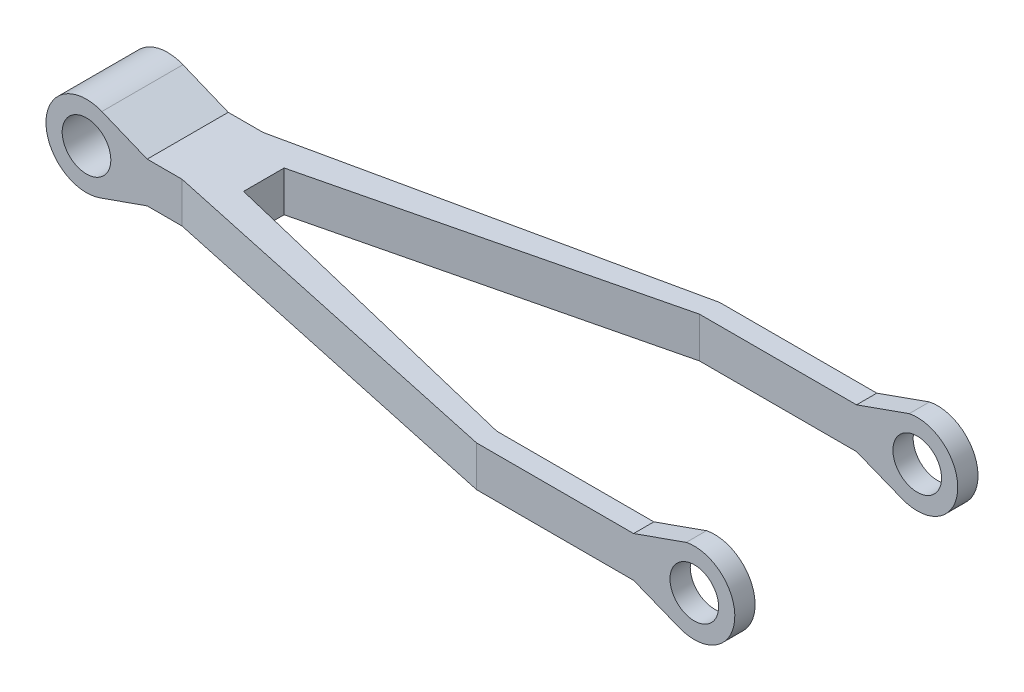
ISO-10303-21;
HEADER;
FILE_DESCRIPTION(('STEP AP214'),'2;1');
FILE_NAME('part.step','',(''),(''),'','','');
FILE_SCHEMA(('AUTOMOTIVE_DESIGN { 1 0 10303 214 1 1 1 1 }'));
ENDSEC;
DATA;
#1=APPLICATION_CONTEXT('core data for automotive mechanical design processes');
#2=APPLICATION_PROTOCOL_DEFINITION('international standard','automotive_design',2000,#1);
#3=PRODUCT_CONTEXT('',#1,'mechanical');
#4=PRODUCT('Part','Part','',(#3));
#5=PRODUCT_RELATED_PRODUCT_CATEGORY('part','',(#4));
#6=PRODUCT_DEFINITION_FORMATION('','',#4);
#7=PRODUCT_DEFINITION_CONTEXT('part definition',#1,'design');
#8=PRODUCT_DEFINITION('design','',#6,#7);
#9=PRODUCT_DEFINITION_SHAPE('','',#8);
#10=(LENGTH_UNIT() NAMED_UNIT(*) SI_UNIT(.MILLI.,.METRE.));
#11=(NAMED_UNIT(*) PLANE_ANGLE_UNIT() SI_UNIT($,.RADIAN.));
#12=(NAMED_UNIT(*) SI_UNIT($,.STERADIAN.) SOLID_ANGLE_UNIT());
#13=UNCERTAINTY_MEASURE_WITH_UNIT(LENGTH_MEASURE(1.E-05),#10,'distance_accuracy_value','');
#14=(GEOMETRIC_REPRESENTATION_CONTEXT(3) GLOBAL_UNCERTAINTY_ASSIGNED_CONTEXT((#13)) GLOBAL_UNIT_ASSIGNED_CONTEXT((#10,
#11,#12)) REPRESENTATION_CONTEXT('',''));
#15=CARTESIAN_POINT('',(0.,0.,0.));
#16=DIRECTION('',(0.,0.,1.));
#17=DIRECTION('',(1.,0.,0.));
#18=AXIS2_PLACEMENT_3D('',#15,#16,#17);
#19=CARTESIAN_POINT('',(425.,-1.27027906957698,300.));
#20=DIRECTION('',(0.,0.,-1.));
#21=DIRECTION('',(-1.,0.,0.));
#22=AXIS2_PLACEMENT_3D('',#19,#20,#21);
#23=CYLINDRICAL_SURFACE('',#22,50.);
#24=CARTESIAN_POINT('',(425.,-1.27027906957698,275.));
#25=DIRECTION('',(0.,0.,-1.));
#26=DIRECTION('',(-1.,0.,0.));
#27=AXIS2_PLACEMENT_3D('',#24,#25,#26);
#28=CIRCLE('',#27,50.);
#29=CARTESIAN_POINT('',(415.157857426218,47.7514735465561,275.));
#30=VERTEX_POINT('',#29);
#31=CARTESIAN_POINT('',(406.561253940114,-47.7462152488414,275.));
#32=VERTEX_POINT('',#31);
#33=EDGE_CURVE('E309',#30,#32,#28,.T.);
#34=ORIENTED_EDGE('',*,*,#33,.F.);
#35=DIRECTION('',(0.,0.,-1.));
#36=VECTOR('',#35,1.);
#37=CARTESIAN_POINT('',(415.157857426218,47.7514735465561,300.));
#38=LINE('',#37,#36);
#39=CARTESIAN_POINT('',(415.157857426218,47.7514735465561,300.));
#40=VERTEX_POINT('',#39);
#41=EDGE_CURVE('E214',#40,#30,#38,.T.);
#42=ORIENTED_EDGE('',*,*,#41,.F.);
#43=CARTESIAN_POINT('',(425.,-1.27027906957698,300.));
#44=DIRECTION('',(0.,0.,1.));
#45=DIRECTION('',(1.,0.,0.));
#46=AXIS2_PLACEMENT_3D('',#43,#44,#45);
#47=CIRCLE('',#46,50.);
#48=CARTESIAN_POINT('',(406.561253940114,-47.7462152488414,300.));
#49=VERTEX_POINT('',#48);
#50=EDGE_CURVE('E319',#49,#40,#47,.T.);
#51=ORIENTED_EDGE('',*,*,#50,.F.);
#52=DIRECTION('',(0.,0.,-1.));
#53=VECTOR('',#52,1.);
#54=CARTESIAN_POINT('',(406.561253940114,-47.7462152488414,300.));
#55=LINE('',#54,#53);
#56=EDGE_CURVE('E218',#49,#32,#55,.T.);
#57=ORIENTED_EDGE('',*,*,#56,.T.);
#58=EDGE_LOOP('',(#34,#42,#51,#57));
#59=FACE_BOUND('',#58,.T.);
#60=ADVANCED_FACE('F35',(#59),#23,.T.);
#61=CARTESIAN_POINT('',(415.157857426218,47.7514735465561,25.));
#62=VERTEX_POINT('',#61);
#63=CARTESIAN_POINT('',(415.157857426218,47.7514735465561,0.));
#64=VERTEX_POINT('',#63);
#65=EDGE_CURVE('E213',#62,#64,#38,.T.);
#66=ORIENTED_EDGE('',*,*,#65,.F.);
#67=CARTESIAN_POINT('',(425.,-1.27027906957698,25.));
#68=DIRECTION('',(0.,0.,1.));
#69=DIRECTION('',(1.,0.,0.));
#70=AXIS2_PLACEMENT_3D('',#67,#68,#69);
#71=CIRCLE('',#70,50.);
#72=CARTESIAN_POINT('',(406.561253940114,-47.7462152488414,25.));
#73=VERTEX_POINT('',#72);
#74=EDGE_CURVE('E313',#73,#62,#71,.T.);
#75=ORIENTED_EDGE('',*,*,#74,.F.);
#76=CARTESIAN_POINT('',(406.561253940114,-47.7462152488414,0.));
#77=VERTEX_POINT('',#76);
#78=EDGE_CURVE('E217',#73,#77,#55,.T.);
#79=ORIENTED_EDGE('',*,*,#78,.T.);
#80=CARTESIAN_POINT('',(425.,-1.27027906957698,0.));
#81=DIRECTION('',(0.,0.,1.));
#82=DIRECTION('',(1.,0.,0.));
#83=AXIS2_PLACEMENT_3D('',#80,#81,#82);
#84=CIRCLE('',#83,50.);
#85=EDGE_CURVE('E334',#77,#64,#84,.T.);
#86=ORIENTED_EDGE('',*,*,#85,.T.);
#87=EDGE_LOOP('',(#66,#75,#79,#86));
#88=FACE_BOUND('',#87,.T.);
#89=ADVANCED_FACE('F414',(#88),#23,.T.);
#90=CARTESIAN_POINT('',(31.4773013212196,-88.584386301868,300.));
#91=DIRECTION('',(-0.334826751212427,0.942279707238,0.));
#92=DIRECTION('',(-0.942279707238,-0.334826751212427,0.));
#93=AXIS2_PLACEMENT_3D('',#90,#91,#92);
#94=PLANE('',#93);
#95=ORIENTED_EDGE('',*,*,#41,.T.);
#96=DIRECTION('',(-0.942279707238,-0.334826751212427,0.));
#97=VECTOR('',#96,1.);
#98=CARTESIAN_POINT('',(31.4773013212196,-88.584386301868,275.));
#99=LINE('',#98,#97);
#100=CARTESIAN_POINT('',(350.126678984303,24.6434961190826,275.));
#101=VERTEX_POINT('',#100);
#102=EDGE_CURVE('E186',#30,#101,#99,.T.);
#103=ORIENTED_EDGE('',*,*,#102,.T.);
#104=DIRECTION('',(0.,0.,-1.));
#105=VECTOR('',#104,1.);
#106=CARTESIAN_POINT('',(350.126678984303,24.6434961190826,300.));
#107=LINE('',#106,#105);
#108=CARTESIAN_POINT('',(350.126678984303,24.6434961190826,300.));
#109=VERTEX_POINT('',#108);
#110=EDGE_CURVE('E206',#109,#101,#107,.T.);
#111=ORIENTED_EDGE('',*,*,#110,.F.);
#112=DIRECTION('',(0.942279707238,0.334826751212427,0.));
#113=VECTOR('',#112,1.);
#114=CARTESIAN_POINT('',(31.4773013212196,-88.584386301868,300.));
#115=LINE('',#114,#113);
#116=EDGE_CURVE('E322',#109,#40,#115,.T.);
#117=ORIENTED_EDGE('',*,*,#116,.T.);
#118=EDGE_LOOP('',(#95,#103,#111,#117));
#119=FACE_BOUND('',#118,.T.);
#120=ADVANCED_FACE('F374',(#119),#94,.T.);
#121=CARTESIAN_POINT('',(350.126678984303,24.6434961190826,25.));
#122=VERTEX_POINT('',#121);
#123=CARTESIAN_POINT('',(350.126678984303,24.6434961190826,0.));
#124=VERTEX_POINT('',#123);
#125=EDGE_CURVE('E204',#122,#124,#107,.T.);
#126=ORIENTED_EDGE('',*,*,#125,.F.);
#127=DIRECTION('',(0.942279707238,0.334826751212427,0.));
#128=VECTOR('',#127,1.);
#129=CARTESIAN_POINT('',(31.4773013212196,-88.584386301868,25.));
#130=LINE('',#129,#128);
#131=EDGE_CURVE('E260',#122,#62,#130,.T.);
#132=ORIENTED_EDGE('',*,*,#131,.T.);
#133=ORIENTED_EDGE('',*,*,#65,.T.);
#134=DIRECTION('',(0.942279707238,0.334826751212427,0.));
#135=VECTOR('',#134,1.);
#136=CARTESIAN_POINT('',(31.4773013212196,-88.584386301868,0.));
#137=LINE('',#136,#135);
#138=EDGE_CURVE('E337',#124,#64,#137,.T.);
#139=ORIENTED_EDGE('',*,*,#138,.F.);
#140=EDGE_LOOP('',(#126,#132,#133,#139));
#141=FACE_BOUND('',#140,.T.);
#142=ADVANCED_FACE('F394',(#141),#94,.T.);
#143=CARTESIAN_POINT('',(-41.6049629686722,-101.596288687072,300.));
#144=DIRECTION('',(-0.378967133157748,-0.925410131771961,0.));
#145=DIRECTION('',(0.925410131771961,-0.378967133157748,0.));
#146=AXIS2_PLACEMENT_3D('',#143,#144,#145);
#147=PLANE('',#146);
#148=DIRECTION('',(0.925410131771961,-0.378967133157748,0.));
#149=VECTOR('',#148,1.);
#150=CARTESIAN_POINT('',(-41.6049629686722,-101.596288687072,100.));
#151=LINE('',#150,#149);
#152=CARTESIAN_POINT('',(-405.780100699834,47.5380282768525,100.));
#153=VERTEX_POINT('',#152);
#154=CARTESIAN_POINT('',(-349.873321015697,24.6434961190825,100.));
#155=VERTEX_POINT('',#154);
#156=EDGE_CURVE('E185',#153,#155,#151,.T.);
#157=ORIENTED_EDGE('',*,*,#156,.F.);
#158=DIRECTION('',(0.,0.,-1.));
#159=VECTOR('',#158,1.);
#160=CARTESIAN_POINT('',(-405.780100699834,47.5380282768525,300.));
#161=LINE('',#160,#159);
#162=CARTESIAN_POINT('',(-405.780100699834,47.5380282768525,200.));
#163=VERTEX_POINT('',#162);
#164=EDGE_CURVE('E183',#163,#153,#161,.T.);
#165=ORIENTED_EDGE('',*,*,#164,.F.);
#166=DIRECTION('',(-0.925410131771961,0.378967133157748,0.));
#167=VECTOR('',#166,1.);
#168=CARTESIAN_POINT('',(-41.6049629686722,-101.596288687072,200.));
#169=LINE('',#168,#167);
#170=CARTESIAN_POINT('',(-349.873321015697,24.6434961190825,200.));
#171=VERTEX_POINT('',#170);
#172=EDGE_CURVE('E176',#171,#163,#169,.T.);
#173=ORIENTED_EDGE('',*,*,#172,.F.);
#174=DIRECTION('',(0.,0.,-1.));
#175=VECTOR('',#174,1.);
#176=CARTESIAN_POINT('',(-349.873321015697,24.6434961190825,300.));
#177=LINE('',#176,#175);
#178=EDGE_CURVE('E181',#171,#155,#177,.T.);
#179=ORIENTED_EDGE('',*,*,#178,.T.);
#180=EDGE_LOOP('',(#157,#165,#173,#179));
#181=FACE_BOUND('',#180,.T.);
#182=ADVANCED_FACE('F179',(#181),#147,.F.);
#183=CARTESIAN_POINT('',(-424.728457357722,1.26752168825442,300.));
#184=DIRECTION('',(0.,0.,-1.));
#185=DIRECTION('',(-1.,0.,0.));
#186=AXIS2_PLACEMENT_3D('',#183,#184,#185);
#187=CYLINDRICAL_SURFACE('',#186,50.);
#188=ORIENTED_EDGE('',*,*,#164,.T.);
#189=CARTESIAN_POINT('',(-424.728457357722,1.26752168825442,100.));
#190=DIRECTION('',(0.,0.,-1.));
#191=DIRECTION('',(-1.,0.,0.));
#192=AXIS2_PLACEMENT_3D('',#189,#190,#191);
#193=CIRCLE('',#192,50.);
#194=CARTESIAN_POINT('',(-408.102340797031,-45.8872474036448,100.));
#195=VERTEX_POINT('',#194);
#196=EDGE_CURVE('E301',#195,#153,#193,.T.);
#197=ORIENTED_EDGE('',*,*,#196,.F.);
#198=DIRECTION('',(0.,0.,-1.));
#199=VECTOR('',#198,1.);
#200=CARTESIAN_POINT('',(-408.102340797031,-45.8872474036448,300.));
#201=LINE('',#200,#199);
#202=CARTESIAN_POINT('',(-408.102340797031,-45.8872474036448,200.));
#203=VERTEX_POINT('',#202);
#204=EDGE_CURVE('E208',#203,#195,#201,.T.);
#205=ORIENTED_EDGE('',*,*,#204,.F.);
#206=CARTESIAN_POINT('',(-424.728457357722,1.26752168825442,200.));
#207=DIRECTION('',(0.,0.,1.));
#208=DIRECTION('',(1.,0.,0.));
#209=AXIS2_PLACEMENT_3D('',#206,#207,#208);
#210=CIRCLE('',#209,50.);
#211=EDGE_CURVE('E306',#163,#203,#210,.T.);
#212=ORIENTED_EDGE('',*,*,#211,.F.);
#213=EDGE_LOOP('',(#188,#197,#205,#212));
#214=FACE_BOUND('',#213,.T.);
#215=ADVANCED_FACE('F357',(#214),#187,.T.);
#216=CARTESIAN_POINT('',(38.9236741876808,98.1093937480238,300.));
#217=DIRECTION('',(0.368774921197711,0.929518723585287,0.));
#218=DIRECTION('',(-0.929518723585287,0.368774921197711,0.));
#219=AXIS2_PLACEMENT_3D('',#216,#217,#218);
#220=PLANE('',#219);
#221=DIRECTION('',(0.929518723585287,-0.368774921197711,0.));
#222=VECTOR('',#221,1.);
#223=CARTESIAN_POINT('',(38.9236741876808,98.1093937480238,25.));
#224=LINE('',#223,#222);
#225=CARTESIAN_POINT('',(350.126678984303,-25.3565038809175,25.));
#226=VERTEX_POINT('',#225);
#227=EDGE_CURVE('E311',#226,#73,#224,.T.);
#228=ORIENTED_EDGE('',*,*,#227,.F.);
#229=DIRECTION('',(0.,0.,-1.));
#230=VECTOR('',#229,1.);
#231=CARTESIAN_POINT('',(350.126678984303,-25.3565038809175,300.));
#232=LINE('',#231,#230);
#233=CARTESIAN_POINT('',(350.126678984303,-25.3565038809175,0.));
#234=VERTEX_POINT('',#233);
#235=EDGE_CURVE('E331',#226,#234,#232,.T.);
#236=ORIENTED_EDGE('',*,*,#235,.T.);
#237=DIRECTION('',(0.929518723585288,-0.368774921197711,0.));
#238=VECTOR('',#237,1.);
#239=CARTESIAN_POINT('',(38.9236741876808,98.1093937480238,0.));
#240=LINE('',#239,#238);
#241=EDGE_CURVE('E315',#234,#77,#240,.T.);
#242=ORIENTED_EDGE('',*,*,#241,.T.);
#243=ORIENTED_EDGE('',*,*,#78,.F.);
#244=EDGE_LOOP('',(#228,#236,#242,#243));
#245=FACE_BOUND('',#244,.T.);
#246=ADVANCED_FACE('F37',(#245),#220,.F.);
#247=DIRECTION('',(-0.929518723585287,0.368774921197711,0.));
#248=VECTOR('',#247,1.);
#249=CARTESIAN_POINT('',(38.9236741876808,98.1093937480238,275.));
#250=LINE('',#249,#248);
#251=CARTESIAN_POINT('',(350.126678984303,-25.3565038809175,275.));
#252=VERTEX_POINT('',#251);
#253=EDGE_CURVE('E60',#32,#252,#250,.T.);
#254=ORIENTED_EDGE('',*,*,#253,.F.);
#255=ORIENTED_EDGE('',*,*,#56,.F.);
#256=DIRECTION('',(0.929518723585288,-0.368774921197711,0.));
#257=VECTOR('',#256,1.);
#258=CARTESIAN_POINT('',(38.9236741876808,98.1093937480238,300.));
#259=LINE('',#258,#257);
#260=CARTESIAN_POINT('',(350.126678984303,-25.3565038809175,300.));
#261=VERTEX_POINT('',#260);
#262=EDGE_CURVE('E316',#261,#49,#259,.T.);
#263=ORIENTED_EDGE('',*,*,#262,.F.);
#264=EDGE_CURVE('E345',#261,#252,#232,.T.);
#265=ORIENTED_EDGE('',*,*,#264,.T.);
#266=EDGE_LOOP('',(#254,#255,#263,#265));
#267=FACE_BOUND('',#266,.T.);
#268=ADVANCED_FACE('F425',(#267),#220,.F.);
#269=CARTESIAN_POINT('',(0.,24.6434961190825,300.));
#270=DIRECTION('',(0.,-1.,0.));
#271=DIRECTION('',(1.,0.,0.));
#272=AXIS2_PLACEMENT_3D('',#269,#270,#271);
#273=PLANE('',#272);
#274=DIRECTION('',(1.,0.,0.));
#275=VECTOR('',#274,1.);
#276=CARTESIAN_POINT('',(156.384680344774,24.6434961190825,25.));
#277=LINE('',#276,#275);
#278=CARTESIAN_POINT('',(156.384680344774,24.6434961190825,25.));
#279=VERTEX_POINT('',#278);
#280=EDGE_CURVE('E279',#279,#122,#277,.T.);
#281=ORIENTED_EDGE('',*,*,#280,.T.);
#282=ORIENTED_EDGE('',*,*,#125,.T.);
#283=DIRECTION('',(-1.,0.,0.));
#284=VECTOR('',#283,1.);
#285=CARTESIAN_POINT('',(0.,24.6434961190825,0.));
#286=LINE('',#285,#284);
#287=CARTESIAN_POINT('',(156.384680344774,24.6434961190825,0.));
#288=VERTEX_POINT('',#287);
#289=EDGE_CURVE('E340',#124,#288,#286,.T.);
#290=ORIENTED_EDGE('',*,*,#289,.T.);
#291=DIRECTION('',(-0.977480249723305,0.,0.21102692103347));
#292=VECTOR('',#291,1.);
#293=CARTESIAN_POINT('',(156.384680344774,24.6434961190825,0.));
#294=LINE('',#293,#292);
#295=CARTESIAN_POINT('',(-306.81700261409,24.6434961190825,100.));
#296=VERTEX_POINT('',#295);
#297=EDGE_CURVE('E265',#288,#296,#294,.T.);
#298=ORIENTED_EDGE('',*,*,#297,.T.);
#299=DIRECTION('',(-1.,0.,0.));
#300=VECTOR('',#299,1.);
#301=CARTESIAN_POINT('',(-306.81700261409,24.6434961190825,100.));
#302=LINE('',#301,#300);
#303=EDGE_CURVE('E197',#296,#155,#302,.T.);
#304=ORIENTED_EDGE('',*,*,#303,.T.);
#305=ORIENTED_EDGE('',*,*,#178,.F.);
#306=DIRECTION('',(1.,0.,0.));
#307=VECTOR('',#306,1.);
#308=CARTESIAN_POINT('',(-623.605485164736,24.6434961190824,200.));
#309=LINE('',#308,#307);
#310=CARTESIAN_POINT('',(-306.81700261409,24.6434961190825,200.));
#311=VERTEX_POINT('',#310);
#312=EDGE_CURVE('E189',#171,#311,#309,.T.);
#313=ORIENTED_EDGE('',*,*,#312,.T.);
#314=DIRECTION('',(0.977480249723305,0.,0.211026921033469));
#315=VECTOR('',#314,1.);
#316=CARTESIAN_POINT('',(156.384680344774,24.6434961190825,300.));
#317=LINE('',#316,#315);
#318=CARTESIAN_POINT('',(156.384680344774,24.6434961190825,300.));
#319=VERTEX_POINT('',#318);
#320=EDGE_CURVE('E196',#311,#319,#317,.T.);
#321=ORIENTED_EDGE('',*,*,#320,.T.);
#322=DIRECTION('',(-1.,0.,0.));
#323=VECTOR('',#322,1.);
#324=CARTESIAN_POINT('',(0.,24.6434961190825,300.));
#325=LINE('',#324,#323);
#326=EDGE_CURVE('E325',#109,#319,#325,.T.);
#327=ORIENTED_EDGE('',*,*,#326,.F.);
#328=ORIENTED_EDGE('',*,*,#110,.T.);
#329=DIRECTION('',(-1.,0.,0.));
#330=VECTOR('',#329,1.);
#331=CARTESIAN_POINT('',(156.384680344774,24.6434961190825,275.));
#332=LINE('',#331,#330);
#333=CARTESIAN_POINT('',(156.384680344774,24.6434961190825,275.));
#334=VERTEX_POINT('',#333);
#335=EDGE_CURVE('E269',#101,#334,#332,.T.);
#336=ORIENTED_EDGE('',*,*,#335,.T.);
#337=DIRECTION('',(-0.971828656597541,0.,-0.235688485539321));
#338=VECTOR('',#337,1.);
#339=CARTESIAN_POINT('',(156.384680344774,24.6434961190825,275.));
#340=LINE('',#339,#338);
#341=CARTESIAN_POINT('',(-255.95139724244,24.6434961190825,175.));
#342=VERTEX_POINT('',#341);
#343=EDGE_CURVE('E52',#334,#342,#340,.T.);
#344=ORIENTED_EDGE('',*,*,#343,.T.);
#345=DIRECTION('',(0.,0.,-1.));
#346=VECTOR('',#345,1.);
#347=CARTESIAN_POINT('',(-255.95139724244,24.6434961190825,150.));
#348=LINE('',#347,#346);
#349=CARTESIAN_POINT('',(-255.95139724244,24.6434961190825,125.));
#350=VERTEX_POINT('',#349);
#351=EDGE_CURVE('E273',#342,#350,#348,.T.);
#352=ORIENTED_EDGE('',*,*,#351,.T.);
#353=DIRECTION('',(0.971828656597541,0.,-0.235688485539321));
#354=VECTOR('',#353,1.);
#355=CARTESIAN_POINT('',(-255.95139724244,24.6434961190825,125.));
#356=LINE('',#355,#354);
#357=EDGE_CURVE('E276',#350,#279,#356,.T.);
#358=ORIENTED_EDGE('',*,*,#357,.T.);
#359=EDGE_LOOP('',(#281,#282,#290,#298,#304,#305,#313,#321,#327,#328,#336,#344,#352,#358));
#360=FACE_BOUND('',#359,.T.);
#361=ADVANCED_FACE('F201',(#360),#273,.F.);
#362=CARTESIAN_POINT('',(-30.7340716416046,87.1675623242215,300.));
#363=DIRECTION('',(0.332522331213809,-0.943095381837985,0.));
#364=DIRECTION('',(0.943095381837985,0.332522331213809,0.));
#365=AXIS2_PLACEMENT_3D('',#362,#363,#364);
#366=PLANE('',#365);
#367=DIRECTION('',(0.,0.,-1.));
#368=VECTOR('',#367,1.);
#369=CARTESIAN_POINT('',(-349.873321015697,-25.3565038809175,300.));
#370=LINE('',#369,#368);
#371=CARTESIAN_POINT('',(-349.873321015697,-25.3565038809175,200.));
#372=VERTEX_POINT('',#371);
#373=CARTESIAN_POINT('',(-349.873321015697,-25.3565038809175,100.));
#374=VERTEX_POINT('',#373);
#375=EDGE_CURVE('E348',#372,#374,#370,.T.);
#376=ORIENTED_EDGE('',*,*,#375,.F.);
#377=DIRECTION('',(-0.943095381837985,-0.332522331213809,0.));
#378=VECTOR('',#377,1.);
#379=CARTESIAN_POINT('',(-30.7340716416046,87.1675623242215,200.));
#380=LINE('',#379,#378);
#381=EDGE_CURVE('E303',#372,#203,#380,.T.);
#382=ORIENTED_EDGE('',*,*,#381,.T.);
#383=ORIENTED_EDGE('',*,*,#204,.T.);
#384=DIRECTION('',(0.943095381837985,0.332522331213809,0.));
#385=VECTOR('',#384,1.);
#386=CARTESIAN_POINT('',(-30.7340716416046,87.1675623242215,100.));
#387=LINE('',#386,#385);
#388=EDGE_CURVE('E298',#195,#374,#387,.T.);
#389=ORIENTED_EDGE('',*,*,#388,.T.);
#390=EDGE_LOOP('',(#376,#382,#383,#389));
#391=FACE_BOUND('',#390,.T.);
#392=ADVANCED_FACE('F354',(#391),#366,.T.);
#393=CARTESIAN_POINT('',(0.,-25.3565038809175,300.));
#394=DIRECTION('',(0.,-1.,0.));
#395=DIRECTION('',(1.,0.,0.));
#396=AXIS2_PLACEMENT_3D('',#393,#394,#395);
#397=PLANE('',#396);
#398=ORIENTED_EDGE('',*,*,#235,.F.);
#399=DIRECTION('',(-1.,0.,0.));
#400=VECTOR('',#399,1.);
#401=CARTESIAN_POINT('',(0.,-25.3565038809175,25.));
#402=LINE('',#401,#400);
#403=CARTESIAN_POINT('',(156.384680344774,-25.3565038809175,25.));
#404=VERTEX_POINT('',#403);
#405=EDGE_CURVE('E12',#226,#404,#402,.T.);
#406=ORIENTED_EDGE('',*,*,#405,.T.);
#407=DIRECTION('',(-0.971828656597541,0.,0.235688485539321));
#408=VECTOR('',#407,1.);
#409=CARTESIAN_POINT('',(-54.3014043381537,-25.3565038809175,76.0957192772843));
#410=LINE('',#409,#408);
#411=CARTESIAN_POINT('',(-255.95139724244,-25.3565038809175,125.));
#412=VERTEX_POINT('',#411);
#413=EDGE_CURVE('E44',#404,#412,#410,.T.);
#414=ORIENTED_EDGE('',*,*,#413,.T.);
#415=DIRECTION('',(0.,0.,1.));
#416=VECTOR('',#415,1.);
#417=CARTESIAN_POINT('',(-255.95139724244,-25.3565038809175,300.));
#418=LINE('',#417,#416);
#419=CARTESIAN_POINT('',(-255.95139724244,-25.3565038809175,175.));
#420=VERTEX_POINT('',#419);
#421=EDGE_CURVE('E237',#412,#420,#418,.T.);
#422=ORIENTED_EDGE('',*,*,#421,.T.);
#423=DIRECTION('',(0.971828656597541,0.,0.235688485539321));
#424=VECTOR('',#423,1.);
#425=CARTESIAN_POINT('',(14.4132429450024,-25.3565038809175,240.568999387461));
#426=LINE('',#425,#424);
#427=CARTESIAN_POINT('',(156.384680344774,-25.3565038809175,275.));
#428=VERTEX_POINT('',#427);
#429=EDGE_CURVE('E234',#420,#428,#426,.T.);
#430=ORIENTED_EDGE('',*,*,#429,.T.);
#431=DIRECTION('',(1.,0.,0.));
#432=VECTOR('',#431,1.);
#433=CARTESIAN_POINT('',(0.,-25.3565038809175,275.));
#434=LINE('',#433,#432);
#435=EDGE_CURVE('E232',#428,#252,#434,.T.);
#436=ORIENTED_EDGE('',*,*,#435,.T.);
#437=ORIENTED_EDGE('',*,*,#264,.F.);
#438=DIRECTION('',(-1.,0.,0.));
#439=VECTOR('',#438,1.);
#440=CARTESIAN_POINT('',(0.,-25.3565038809175,300.));
#441=LINE('',#440,#439);
#442=CARTESIAN_POINT('',(156.384680344774,-25.3565038809175,300.));
#443=VERTEX_POINT('',#442);
#444=EDGE_CURVE('E328',#261,#443,#441,.T.);
#445=ORIENTED_EDGE('',*,*,#444,.T.);
#446=DIRECTION('',(-0.977480249723305,0.,-0.211026921033469));
#447=VECTOR('',#446,1.);
#448=CARTESIAN_POINT('',(6.9641791026724,-25.3565038809175,267.741805192152));
#449=LINE('',#448,#447);
#450=CARTESIAN_POINT('',(-306.81700261409,-25.3565038809175,200.));
#451=VERTEX_POINT('',#450);
#452=EDGE_CURVE('E295',#443,#451,#449,.T.);
#453=ORIENTED_EDGE('',*,*,#452,.T.);
#454=DIRECTION('',(-1.,0.,0.));
#455=VECTOR('',#454,1.);
#456=CARTESIAN_POINT('',(0.,-25.3565038809175,200.));
#457=LINE('',#456,#455);
#458=EDGE_CURVE('E229',#451,#372,#457,.T.);
#459=ORIENTED_EDGE('',*,*,#458,.T.);
#460=ORIENTED_EDGE('',*,*,#375,.T.);
#461=DIRECTION('',(1.,0.,0.));
#462=VECTOR('',#461,1.);
#463=CARTESIAN_POINT('',(0.,-25.3565038809175,100.));
#464=LINE('',#463,#462);
#465=CARTESIAN_POINT('',(-306.81700261409,-25.3565038809175,100.));
#466=VERTEX_POINT('',#465);
#467=EDGE_CURVE('E226',#374,#466,#464,.T.);
#468=ORIENTED_EDGE('',*,*,#467,.T.);
#469=DIRECTION('',(0.977480249723305,0.,-0.211026921033469));
#470=VECTOR('',#469,1.);
#471=CARTESIAN_POINT('',(-54.9182151383683,-25.3565038809175,45.617903228108));
#472=LINE('',#471,#470);
#473=CARTESIAN_POINT('',(156.384680344774,-25.3565038809175,0.));
#474=VERTEX_POINT('',#473);
#475=EDGE_CURVE('E284',#466,#474,#472,.T.);
#476=ORIENTED_EDGE('',*,*,#475,.T.);
#477=DIRECTION('',(-1.,0.,0.));
#478=VECTOR('',#477,1.);
#479=CARTESIAN_POINT('',(0.,-25.3565038809175,0.));
#480=LINE('',#479,#478);
#481=EDGE_CURVE('E320',#234,#474,#480,.T.);
#482=ORIENTED_EDGE('',*,*,#481,.F.);
#483=EDGE_LOOP('',(#398,#406,#414,#422,#430,#436,#437,#445,#453,#459,#460,#468,#476,#482));
#484=FACE_BOUND('',#483,.T.);
#485=ADVANCED_FACE('F363',(#484),#397,.T.);
#486=CARTESIAN_POINT('',(0.,0.,300.));
#487=DIRECTION('',(0.,0.,1.));
#488=DIRECTION('',(1.,0.,0.));
#489=AXIS2_PLACEMENT_3D('',#486,#487,#488);
#490=PLANE('',#489);
#491=CARTESIAN_POINT('',(425.,-1.27027906957698,300.));
#492=DIRECTION('',(0.,0.,1.));
#493=DIRECTION('',(1.,0.,0.));
#494=AXIS2_PLACEMENT_3D('',#491,#492,#493);
#495=CIRCLE('',#494,30.);
#496=CARTESIAN_POINT('',(455.,-1.27027906957698,300.));
#497=VERTEX_POINT('',#496);
#498=EDGE_CURVE('E248',#497,#497,#495,.T.);
#499=ORIENTED_EDGE('',*,*,#498,.F.);
#500=EDGE_LOOP('',(#499));
#501=FACE_BOUND('',#500,.T.);
#502=ORIENTED_EDGE('',*,*,#116,.F.);
#503=ORIENTED_EDGE('',*,*,#326,.T.);
#504=DIRECTION('',(0.,-1.,0.));
#505=VECTOR('',#504,1.);
#506=CARTESIAN_POINT('',(156.384680344774,0.,300.));
#507=LINE('',#506,#505);
#508=EDGE_CURVE('E223',#319,#443,#507,.T.);
#509=ORIENTED_EDGE('',*,*,#508,.T.);
#510=ORIENTED_EDGE('',*,*,#444,.F.);
#511=ORIENTED_EDGE('',*,*,#262,.T.);
#512=ORIENTED_EDGE('',*,*,#50,.T.);
#513=EDGE_LOOP('',(#502,#503,#509,#510,#511,#512));
#514=FACE_BOUND('',#513,.T.);
#515=ADVANCED_FACE('F370',(#501,#514),#490,.T.);
#516=CARTESIAN_POINT('',(0.,0.,0.));
#517=DIRECTION('',(0.,0.,1.));
#518=DIRECTION('',(1.,0.,0.));
#519=AXIS2_PLACEMENT_3D('',#516,#517,#518);
#520=PLANE('',#519);
#521=CARTESIAN_POINT('',(425.,-1.27027906957698,0.));
#522=DIRECTION('',(0.,0.,1.));
#523=DIRECTION('',(1.,0.,0.));
#524=AXIS2_PLACEMENT_3D('',#521,#522,#523);
#525=CIRCLE('',#524,30.);
#526=CARTESIAN_POINT('',(455.,-1.27027906957698,0.));
#527=VERTEX_POINT('',#526);
#528=EDGE_CURVE('E244',#527,#527,#525,.T.);
#529=ORIENTED_EDGE('',*,*,#528,.T.);
#530=EDGE_LOOP('',(#529));
#531=FACE_BOUND('',#530,.T.);
#532=ORIENTED_EDGE('',*,*,#138,.T.);
#533=ORIENTED_EDGE('',*,*,#85,.F.);
#534=ORIENTED_EDGE('',*,*,#241,.F.);
#535=ORIENTED_EDGE('',*,*,#481,.T.);
#536=DIRECTION('',(0.,-1.,0.));
#537=VECTOR('',#536,1.);
#538=CARTESIAN_POINT('',(156.384680344774,0.,0.));
#539=LINE('',#538,#537);
#540=EDGE_CURVE('E221',#288,#474,#539,.T.);
#541=ORIENTED_EDGE('',*,*,#540,.F.);
#542=ORIENTED_EDGE('',*,*,#289,.F.);
#543=EDGE_LOOP('',(#532,#533,#534,#535,#541,#542));
#544=FACE_BOUND('',#543,.T.);
#545=ADVANCED_FACE('F398',(#531,#544),#520,.F.);
#546=CARTESIAN_POINT('',(156.384680344774,-275.356503880918,0.));
#547=DIRECTION('',(-0.211026921033469,0.,-0.977480249723305));
#548=DIRECTION('',(-0.977480249723305,0.,0.211026921033469));
#549=AXIS2_PLACEMENT_3D('',#546,#547,#548);
#550=PLANE('',#549);
#551=DIRECTION('',(0.,1.,0.));
#552=VECTOR('',#551,1.);
#553=CARTESIAN_POINT('',(-306.81700261409,-275.356503880918,100.));
#554=LINE('',#553,#552);
#555=EDGE_CURVE('E281',#466,#296,#554,.T.);
#556=ORIENTED_EDGE('',*,*,#555,.T.);
#557=ORIENTED_EDGE('',*,*,#297,.F.);
#558=ORIENTED_EDGE('',*,*,#540,.T.);
#559=ORIENTED_EDGE('',*,*,#475,.F.);
#560=EDGE_LOOP('',(#556,#557,#558,#559));
#561=FACE_BOUND('',#560,.T.);
#562=ADVANCED_FACE('F402',(#561),#550,.T.);
#563=CARTESIAN_POINT('',(-306.81700261409,-275.356503880918,100.));
#564=DIRECTION('',(0.,0.,-1.));
#565=DIRECTION('',(-1.,0.,0.));
#566=AXIS2_PLACEMENT_3D('',#563,#564,#565);
#567=PLANE('',#566);
#568=CARTESIAN_POINT('',(-424.728457357722,1.26752168825442,100.));
#569=DIRECTION('',(0.,0.,-1.));
#570=DIRECTION('',(-1.,0.,0.));
#571=AXIS2_PLACEMENT_3D('',#568,#569,#570);
#572=CIRCLE('',#571,30.);
#573=CARTESIAN_POINT('',(-454.728457357722,1.26752168825442,100.));
#574=VERTEX_POINT('',#573);
#575=EDGE_CURVE('E257',#574,#574,#572,.T.);
#576=ORIENTED_EDGE('',*,*,#575,.F.);
#577=EDGE_LOOP('',(#576));
#578=FACE_BOUND('',#577,.T.);
#579=ORIENTED_EDGE('',*,*,#196,.T.);
#580=ORIENTED_EDGE('',*,*,#156,.T.);
#581=ORIENTED_EDGE('',*,*,#303,.F.);
#582=ORIENTED_EDGE('',*,*,#555,.F.);
#583=ORIENTED_EDGE('',*,*,#467,.F.);
#584=ORIENTED_EDGE('',*,*,#388,.F.);
#585=EDGE_LOOP('',(#579,#580,#581,#582,#583,#584));
#586=FACE_BOUND('',#585,.T.);
#587=ADVANCED_FACE('F359',(#578,#586),#567,.T.);
#588=CARTESIAN_POINT('',(156.384680344774,-275.356503880918,300.));
#589=DIRECTION('',(-0.211026921033469,0.,0.977480249723305));
#590=DIRECTION('',(0.977480249723305,0.,0.211026921033469));
#591=AXIS2_PLACEMENT_3D('',#588,#589,#590);
#592=PLANE('',#591);
#593=ORIENTED_EDGE('',*,*,#508,.F.);
#594=ORIENTED_EDGE('',*,*,#320,.F.);
#595=DIRECTION('',(0.,1.,0.));
#596=VECTOR('',#595,1.);
#597=CARTESIAN_POINT('',(-306.81700261409,-275.356503880918,200.));
#598=LINE('',#597,#596);
#599=EDGE_CURVE('E192',#451,#311,#598,.T.);
#600=ORIENTED_EDGE('',*,*,#599,.F.);
#601=ORIENTED_EDGE('',*,*,#452,.F.);
#602=EDGE_LOOP('',(#593,#594,#600,#601));
#603=FACE_BOUND('',#602,.T.);
#604=ADVANCED_FACE('F366',(#603),#592,.T.);
#605=CARTESIAN_POINT('',(-623.605485164736,-275.356503880918,200.));
#606=DIRECTION('',(0.,0.,1.));
#607=DIRECTION('',(1.,0.,0.));
#608=AXIS2_PLACEMENT_3D('',#605,#606,#607);
#609=PLANE('',#608);
#610=CARTESIAN_POINT('',(-424.728457357722,1.26752168825442,200.));
#611=DIRECTION('',(0.,0.,1.));
#612=DIRECTION('',(1.,0.,0.));
#613=AXIS2_PLACEMENT_3D('',#610,#611,#612);
#614=CIRCLE('',#613,30.);
#615=CARTESIAN_POINT('',(-394.728457357722,1.26752168825442,200.));
#616=VERTEX_POINT('',#615);
#617=EDGE_CURVE('E39',#616,#616,#614,.T.);
#618=ORIENTED_EDGE('',*,*,#617,.F.);
#619=EDGE_LOOP('',(#618));
#620=FACE_BOUND('',#619,.T.);
#621=ORIENTED_EDGE('',*,*,#211,.T.);
#622=ORIENTED_EDGE('',*,*,#381,.F.);
#623=ORIENTED_EDGE('',*,*,#458,.F.);
#624=ORIENTED_EDGE('',*,*,#599,.T.);
#625=ORIENTED_EDGE('',*,*,#312,.F.);
#626=ORIENTED_EDGE('',*,*,#172,.T.);
#627=EDGE_LOOP('',(#621,#622,#623,#624,#625,#626));
#628=FACE_BOUND('',#627,.T.);
#629=ADVANCED_FACE('F190',(#620,#628),#609,.T.);
#630=CARTESIAN_POINT('',(156.384680344774,-275.356503880918,25.));
#631=DIRECTION('',(0.,0.,1.));
#632=DIRECTION('',(1.,0.,0.));
#633=AXIS2_PLACEMENT_3D('',#630,#631,#632);
#634=PLANE('',#633);
#635=CARTESIAN_POINT('',(425.,-1.27027906957698,25.));
#636=DIRECTION('',(0.,0.,1.));
#637=DIRECTION('',(1.,0.,0.));
#638=AXIS2_PLACEMENT_3D('',#635,#636,#637);
#639=CIRCLE('',#638,30.);
#640=CARTESIAN_POINT('',(455.,-1.27027906957698,25.));
#641=VERTEX_POINT('',#640);
#642=EDGE_CURVE('E243',#641,#641,#639,.T.);
#643=ORIENTED_EDGE('',*,*,#642,.F.);
#644=EDGE_LOOP('',(#643));
#645=FACE_BOUND('',#644,.T.);
#646=ORIENTED_EDGE('',*,*,#74,.T.);
#647=ORIENTED_EDGE('',*,*,#131,.F.);
#648=ORIENTED_EDGE('',*,*,#280,.F.);
#649=DIRECTION('',(0.,1.,0.));
#650=VECTOR('',#649,1.);
#651=CARTESIAN_POINT('',(156.384680344774,-275.356503880918,25.));
#652=LINE('',#651,#650);
#653=EDGE_CURVE('E282',#404,#279,#652,.T.);
#654=ORIENTED_EDGE('',*,*,#653,.F.);
#655=ORIENTED_EDGE('',*,*,#405,.F.);
#656=ORIENTED_EDGE('',*,*,#227,.T.);
#657=EDGE_LOOP('',(#646,#647,#648,#654,#655,#656));
#658=FACE_BOUND('',#657,.T.);
#659=ADVANCED_FACE('F452',(#645,#658),#634,.T.);
#660=CARTESIAN_POINT('',(156.384680344774,-275.356503880918,275.));
#661=DIRECTION('',(0.,0.,-1.));
#662=DIRECTION('',(-1.,0.,0.));
#663=AXIS2_PLACEMENT_3D('',#660,#661,#662);
#664=PLANE('',#663);
#665=CARTESIAN_POINT('',(425.,-1.27027906957698,275.));
#666=DIRECTION('',(0.,0.,-1.));
#667=DIRECTION('',(-1.,0.,0.));
#668=AXIS2_PLACEMENT_3D('',#665,#666,#667);
#669=CIRCLE('',#668,30.);
#670=CARTESIAN_POINT('',(395.,-1.27027906957698,275.));
#671=VERTEX_POINT('',#670);
#672=EDGE_CURVE('E241',#671,#671,#669,.T.);
#673=ORIENTED_EDGE('',*,*,#672,.F.);
#674=EDGE_LOOP('',(#673));
#675=FACE_BOUND('',#674,.T.);
#676=ORIENTED_EDGE('',*,*,#33,.T.);
#677=ORIENTED_EDGE('',*,*,#253,.T.);
#678=ORIENTED_EDGE('',*,*,#435,.F.);
#679=DIRECTION('',(0.,1.,0.));
#680=VECTOR('',#679,1.);
#681=CARTESIAN_POINT('',(156.384680344774,-275.356503880918,275.));
#682=LINE('',#681,#680);
#683=EDGE_CURVE('E289',#428,#334,#682,.T.);
#684=ORIENTED_EDGE('',*,*,#683,.T.);
#685=ORIENTED_EDGE('',*,*,#335,.F.);
#686=ORIENTED_EDGE('',*,*,#102,.F.);
#687=EDGE_LOOP('',(#676,#677,#678,#684,#685,#686));
#688=FACE_BOUND('',#687,.T.);
#689=ADVANCED_FACE('F377',(#675,#688),#664,.T.);
#690=CARTESIAN_POINT('',(-255.951397242439,-275.356503880918,125.));
#691=DIRECTION('',(0.235688485539321,0.,0.971828656597541));
#692=DIRECTION('',(0.971828656597541,0.,-0.235688485539321));
#693=AXIS2_PLACEMENT_3D('',#690,#691,#692);
#694=PLANE('',#693);
#695=ORIENTED_EDGE('',*,*,#653,.T.);
#696=ORIENTED_EDGE('',*,*,#357,.F.);
#697=DIRECTION('',(0.,1.,0.));
#698=VECTOR('',#697,1.);
#699=CARTESIAN_POINT('',(-255.951397242439,-275.356503880918,125.));
#700=LINE('',#699,#698);
#701=EDGE_CURVE('E285',#412,#350,#700,.T.);
#702=ORIENTED_EDGE('',*,*,#701,.F.);
#703=ORIENTED_EDGE('',*,*,#413,.F.);
#704=EDGE_LOOP('',(#695,#696,#702,#703));
#705=FACE_BOUND('',#704,.T.);
#706=ADVANCED_FACE('F386',(#705),#694,.T.);
#707=CARTESIAN_POINT('',(-255.951397242439,-275.356503880918,150.));
#708=DIRECTION('',(1.,0.,0.));
#709=DIRECTION('',(0.,1.,0.));
#710=AXIS2_PLACEMENT_3D('',#707,#708,#709);
#711=PLANE('',#710);
#712=ORIENTED_EDGE('',*,*,#701,.T.);
#713=ORIENTED_EDGE('',*,*,#351,.F.);
#714=DIRECTION('',(0.,1.,0.));
#715=VECTOR('',#714,1.);
#716=CARTESIAN_POINT('',(-255.951397242439,-275.356503880918,175.));
#717=LINE('',#716,#715);
#718=EDGE_CURVE('E287',#420,#342,#717,.T.);
#719=ORIENTED_EDGE('',*,*,#718,.F.);
#720=ORIENTED_EDGE('',*,*,#421,.F.);
#721=EDGE_LOOP('',(#712,#713,#719,#720));
#722=FACE_BOUND('',#721,.T.);
#723=ADVANCED_FACE('F382',(#722),#711,.T.);
#724=CARTESIAN_POINT('',(156.384680344774,-275.356503880918,275.));
#725=DIRECTION('',(0.235688485539321,0.,-0.971828656597541));
#726=DIRECTION('',(-0.971828656597541,0.,-0.235688485539321));
#727=AXIS2_PLACEMENT_3D('',#724,#725,#726);
#728=PLANE('',#727);
#729=ORIENTED_EDGE('',*,*,#718,.T.);
#730=ORIENTED_EDGE('',*,*,#343,.F.);
#731=ORIENTED_EDGE('',*,*,#683,.F.);
#732=ORIENTED_EDGE('',*,*,#429,.F.);
#733=EDGE_LOOP('',(#729,#730,#731,#732));
#734=FACE_BOUND('',#733,.T.);
#735=ADVANCED_FACE('F378',(#734),#728,.T.);
#736=CARTESIAN_POINT('',(425.,-1.27027906957698,0.));
#737=DIRECTION('',(0.,0.,1.));
#738=DIRECTION('',(1.,0.,0.));
#739=AXIS2_PLACEMENT_3D('',#736,#737,#738);
#740=CYLINDRICAL_SURFACE('',#739,30.);
#741=ORIENTED_EDGE('',*,*,#498,.T.);
#742=EDGE_LOOP('',(#741));
#743=FACE_BOUND('',#742,.T.);
#744=ORIENTED_EDGE('',*,*,#672,.T.);
#745=EDGE_LOOP('',(#744));
#746=FACE_BOUND('',#745,.T.);
#747=ADVANCED_FACE('F439',(#743,#746),#740,.F.);
#748=ORIENTED_EDGE('',*,*,#642,.T.);
#749=EDGE_LOOP('',(#748));
#750=FACE_BOUND('',#749,.T.);
#751=ORIENTED_EDGE('',*,*,#528,.F.);
#752=EDGE_LOOP('',(#751));
#753=FACE_BOUND('',#752,.T.);
#754=ADVANCED_FACE('F441',(#750,#753),#740,.F.);
#755=CARTESIAN_POINT('',(-424.728457357722,1.26752168825442,0.));
#756=DIRECTION('',(0.,0.,1.));
#757=DIRECTION('',(1.,0.,0.));
#758=AXIS2_PLACEMENT_3D('',#755,#756,#757);
#759=CYLINDRICAL_SURFACE('',#758,30.);
#760=ORIENTED_EDGE('',*,*,#575,.T.);
#761=EDGE_LOOP('',(#760));
#762=FACE_BOUND('',#761,.T.);
#763=ORIENTED_EDGE('',*,*,#617,.T.);
#764=EDGE_LOOP('',(#763));
#765=FACE_BOUND('',#764,.T.);
#766=ADVANCED_FACE('F447',(#762,#765),#759,.F.);
#767=CLOSED_SHELL('',(#60,#89,#120,#142,#182,#215,#246,#268,#361,#392,#485,#515,#545,#562,#587,
#604,#629,#659,#689,#706,#723,#735,#747,#754,#766));
#768=MANIFOLD_SOLID_BREP('B2',#767);
#769=ADVANCED_BREP_SHAPE_REPRESENTATION('',(#18,#768),#14);
#770=SHAPE_DEFINITION_REPRESENTATION(#9,#769);
ENDSEC;
END-ISO-10303-21;
